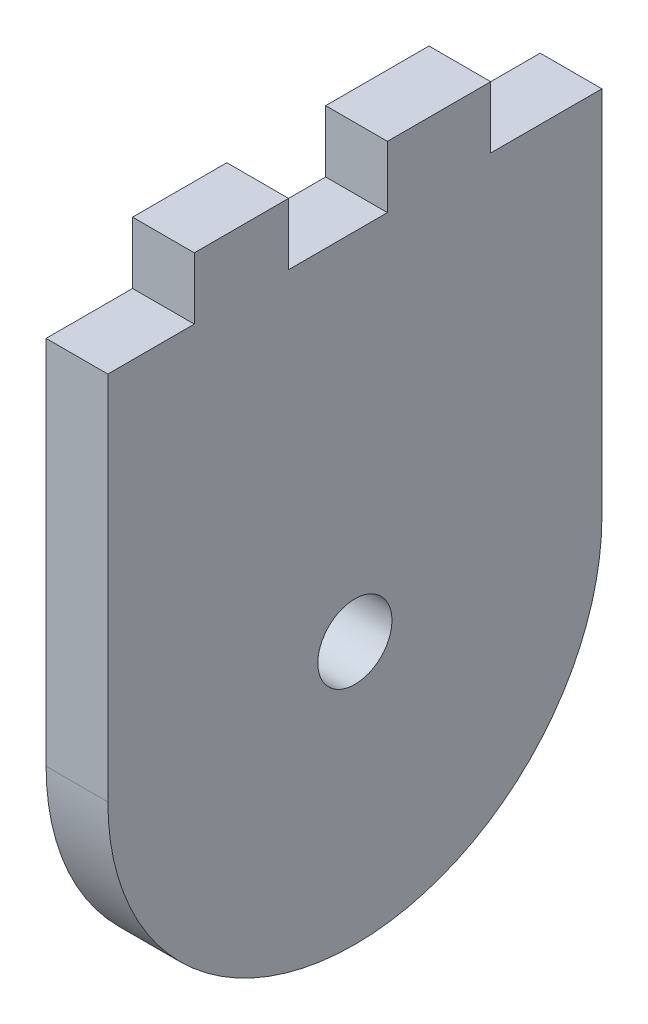
ISO-10303-21;
HEADER;
FILE_DESCRIPTION(('STEP AP214'),'2;1');
FILE_NAME('part.step','',(''),(''),'','','');
FILE_SCHEMA(('AUTOMOTIVE_DESIGN { 1 0 10303 214 1 1 1 1 }'));
ENDSEC;
DATA;
#1=APPLICATION_CONTEXT('core data for automotive mechanical design processes');
#2=APPLICATION_PROTOCOL_DEFINITION('international standard','automotive_design',2000,#1);
#3=PRODUCT_CONTEXT('',#1,'mechanical');
#4=PRODUCT('Part','Part','',(#3));
#5=PRODUCT_RELATED_PRODUCT_CATEGORY('part','',(#4));
#6=PRODUCT_DEFINITION_FORMATION('','',#4);
#7=PRODUCT_DEFINITION_CONTEXT('part definition',#1,'design');
#8=PRODUCT_DEFINITION('design','',#6,#7);
#9=PRODUCT_DEFINITION_SHAPE('','',#8);
#10=(LENGTH_UNIT() NAMED_UNIT(*) SI_UNIT(.MILLI.,.METRE.));
#11=(NAMED_UNIT(*) PLANE_ANGLE_UNIT() SI_UNIT($,.RADIAN.));
#12=(NAMED_UNIT(*) SI_UNIT($,.STERADIAN.) SOLID_ANGLE_UNIT());
#13=UNCERTAINTY_MEASURE_WITH_UNIT(LENGTH_MEASURE(1.E-05),#10,'distance_accuracy_value','');
#14=(GEOMETRIC_REPRESENTATION_CONTEXT(3) GLOBAL_UNCERTAINTY_ASSIGNED_CONTEXT((#13)) GLOBAL_UNIT_ASSIGNED_CONTEXT((#10,
#11,#12)) REPRESENTATION_CONTEXT('',''));
#15=CARTESIAN_POINT('',(0.,0.,0.));
#16=DIRECTION('',(0.,0.,1.));
#17=DIRECTION('',(1.,0.,0.));
#18=AXIS2_PLACEMENT_3D('',#15,#16,#17);
#19=CARTESIAN_POINT('',(-5.,55.,40.));
#20=DIRECTION('',(0.,-1.,0.));
#21=DIRECTION('',(0.,0.,-1.));
#22=AXIS2_PLACEMENT_3D('',#19,#20,#21);
#23=PLANE('',#22);
#24=DIRECTION('',(0.,0.,-1.));
#25=VECTOR('',#24,1.);
#26=CARTESIAN_POINT('',(-5.,55.,40.));
#27=LINE('',#26,#25);
#28=CARTESIAN_POINT('',(-5.,55.,33.));
#29=VERTEX_POINT('',#28);
#30=CARTESIAN_POINT('',(-5.,55.,25.3660375931076));
#31=VERTEX_POINT('',#30);
#32=EDGE_CURVE('E220',#29,#31,#27,.T.);
#33=ORIENTED_EDGE('',*,*,#32,.F.);
#34=DIRECTION('',(-1.,0.,0.));
#35=VECTOR('',#34,1.);
#36=CARTESIAN_POINT('',(0.,55.,33.));
#37=LINE('',#36,#35);
#38=CARTESIAN_POINT('',(0.,55.,33.));
#39=VERTEX_POINT('',#38);
#40=EDGE_CURVE('E192',#39,#29,#37,.T.);
#41=ORIENTED_EDGE('',*,*,#40,.F.);
#42=DIRECTION('',(0.,0.,-1.));
#43=VECTOR('',#42,1.);
#44=CARTESIAN_POINT('',(0.,55.,40.));
#45=LINE('',#44,#43);
#46=CARTESIAN_POINT('',(0.,55.,25.3660375931076));
#47=VERTEX_POINT('',#46);
#48=EDGE_CURVE('E223',#39,#47,#45,.T.);
#49=ORIENTED_EDGE('',*,*,#48,.T.);
#50=DIRECTION('',(-1.,0.,0.));
#51=VECTOR('',#50,1.);
#52=CARTESIAN_POINT('',(0.,55.,25.3660375931076));
#53=LINE('',#52,#51);
#54=EDGE_CURVE('E194',#47,#31,#53,.T.);
#55=ORIENTED_EDGE('',*,*,#54,.T.);
#56=EDGE_LOOP('',(#33,#41,#49,#55));
#57=FACE_BOUND('',#56,.T.);
#58=ADVANCED_FACE('F36',(#57),#23,.F.);
#59=CARTESIAN_POINT('',(0.,51.5,40.));
#60=DIRECTION('',(-1.,0.,0.));
#61=DIRECTION('',(0.,0.,1.));
#62=AXIS2_PLACEMENT_3D('',#59,#60,#61);
#63=PLANE('',#62);
#64=CARTESIAN_POINT('',(0.,21.2375980792143,20.));
#65=DIRECTION('',(-1.,0.,0.));
#66=DIRECTION('',(0.,0.,1.));
#67=AXIS2_PLACEMENT_3D('',#64,#65,#66);
#68=CIRCLE('',#67,3.);
#69=CARTESIAN_POINT('',(0.,21.2375980792143,23.));
#70=VERTEX_POINT('',#69);
#71=EDGE_CURVE('E206',#70,#70,#68,.T.);
#72=ORIENTED_EDGE('',*,*,#71,.T.);
#73=EDGE_LOOP('',(#72));
#74=FACE_BOUND('',#73,.T.);
#75=DIRECTION('',(0.,-1.,0.));
#76=VECTOR('',#75,1.);
#77=CARTESIAN_POINT('',(0.,55.,33.));
#78=LINE('',#77,#76);
#79=CARTESIAN_POINT('',(0.,50.,33.));
#80=VERTEX_POINT('',#79);
#81=EDGE_CURVE('E170',#39,#80,#78,.T.);
#82=ORIENTED_EDGE('',*,*,#81,.T.);
#83=DIRECTION('',(0.,0.,1.));
#84=VECTOR('',#83,1.);
#85=CARTESIAN_POINT('',(0.,50.,33.));
#86=LINE('',#85,#84);
#87=CARTESIAN_POINT('',(0.,50.,40.));
#88=VERTEX_POINT('',#87);
#89=EDGE_CURVE('E172',#80,#88,#86,.T.);
#90=ORIENTED_EDGE('',*,*,#89,.T.);
#91=DIRECTION('',(0.,1.,0.));
#92=VECTOR('',#91,1.);
#93=CARTESIAN_POINT('',(0.,0.,40.));
#94=LINE('',#93,#92);
#95=CARTESIAN_POINT('',(0.,20.,40.));
#96=VERTEX_POINT('',#95);
#97=EDGE_CURVE('E209',#96,#88,#94,.T.);
#98=ORIENTED_EDGE('',*,*,#97,.F.);
#99=CARTESIAN_POINT('',(0.,20.,20.));
#100=DIRECTION('',(-1.,0.,0.));
#101=DIRECTION('',(0.,0.,1.));
#102=AXIS2_PLACEMENT_3D('',#99,#100,#101);
#103=CIRCLE('',#102,20.);
#104=CARTESIAN_POINT('',(0.,0.,20.));
#105=VERTEX_POINT('',#104);
#106=EDGE_CURVE('E224',#96,#105,#103,.F.);
#107=ORIENTED_EDGE('',*,*,#106,.T.);
#108=CARTESIAN_POINT('',(0.,20.,20.));
#109=DIRECTION('',(-1.,0.,0.));
#110=DIRECTION('',(0.,0.,1.));
#111=AXIS2_PLACEMENT_3D('',#108,#109,#110);
#112=CIRCLE('',#111,20.);
#113=CARTESIAN_POINT('',(0.,20.,0.));
#114=VERTEX_POINT('',#113);
#115=EDGE_CURVE('E226',#105,#114,#112,.F.);
#116=ORIENTED_EDGE('',*,*,#115,.T.);
#117=DIRECTION('',(0.,1.,0.));
#118=VECTOR('',#117,1.);
#119=CARTESIAN_POINT('',(0.,51.5,0.));
#120=LINE('',#119,#118);
#121=CARTESIAN_POINT('',(0.,50.,0.));
#122=VERTEX_POINT('',#121);
#123=EDGE_CURVE('E157',#114,#122,#120,.T.);
#124=ORIENTED_EDGE('',*,*,#123,.T.);
#125=DIRECTION('',(0.,0.,1.));
#126=VECTOR('',#125,1.);
#127=CARTESIAN_POINT('',(0.,50.,0.));
#128=LINE('',#127,#126);
#129=CARTESIAN_POINT('',(0.,50.,9.00000000000001));
#130=VERTEX_POINT('',#129);
#131=EDGE_CURVE('E135',#122,#130,#128,.T.);
#132=ORIENTED_EDGE('',*,*,#131,.T.);
#133=DIRECTION('',(0.,1.,0.));
#134=VECTOR('',#133,1.);
#135=CARTESIAN_POINT('',(0.,50.,9.00000000000001));
#136=LINE('',#135,#134);
#137=CARTESIAN_POINT('',(0.,55.,9.));
#138=VERTEX_POINT('',#137);
#139=EDGE_CURVE('E145',#130,#138,#136,.T.);
#140=ORIENTED_EDGE('',*,*,#139,.T.);
#141=CARTESIAN_POINT('',(0.,55.,17.3660375931076));
#142=VERTEX_POINT('',#141);
#143=EDGE_CURVE('E221',#142,#138,#45,.T.);
#144=ORIENTED_EDGE('',*,*,#143,.F.);
#145=DIRECTION('',(0.,-1.,0.));
#146=VECTOR('',#145,1.);
#147=CARTESIAN_POINT('',(0.,55.,17.3660375931076));
#148=LINE('',#147,#146);
#149=CARTESIAN_POINT('',(0.,50.,17.3660375931076));
#150=VERTEX_POINT('',#149);
#151=EDGE_CURVE('E151',#142,#150,#148,.T.);
#152=ORIENTED_EDGE('',*,*,#151,.T.);
#153=DIRECTION('',(0.,0.,1.));
#154=VECTOR('',#153,1.);
#155=CARTESIAN_POINT('',(0.,50.,17.3660375931076));
#156=LINE('',#155,#154);
#157=CARTESIAN_POINT('',(0.,50.,25.3660375931076));
#158=VERTEX_POINT('',#157);
#159=EDGE_CURVE('E164',#150,#158,#156,.T.);
#160=ORIENTED_EDGE('',*,*,#159,.T.);
#161=DIRECTION('',(0.,1.,0.));
#162=VECTOR('',#161,1.);
#163=CARTESIAN_POINT('',(0.,50.,25.3660375931076));
#164=LINE('',#163,#162);
#165=EDGE_CURVE('E167',#158,#47,#164,.T.);
#166=ORIENTED_EDGE('',*,*,#165,.T.);
#167=ORIENTED_EDGE('',*,*,#48,.F.);
#168=EDGE_LOOP('',(#82,#90,#98,#107,#116,#124,#132,#140,#144,#152,#160,#166,#167));
#169=FACE_BOUND('',#168,.T.);
#170=ADVANCED_FACE('F155',(#74,#169),#63,.F.);
#171=CARTESIAN_POINT('',(-5.,55.,17.3660375931076));
#172=VERTEX_POINT('',#171);
#173=CARTESIAN_POINT('',(-5.,55.,9.));
#174=VERTEX_POINT('',#173);
#175=EDGE_CURVE('E215',#172,#174,#27,.T.);
#176=ORIENTED_EDGE('',*,*,#175,.F.);
#177=DIRECTION('',(-1.,0.,0.));
#178=VECTOR('',#177,1.);
#179=CARTESIAN_POINT('',(0.,55.,17.3660375931076));
#180=LINE('',#179,#178);
#181=EDGE_CURVE('E52',#142,#172,#180,.T.);
#182=ORIENTED_EDGE('',*,*,#181,.F.);
#183=ORIENTED_EDGE('',*,*,#143,.T.);
#184=DIRECTION('',(-1.,0.,0.));
#185=VECTOR('',#184,1.);
#186=CARTESIAN_POINT('',(0.,55.,9.));
#187=LINE('',#186,#185);
#188=EDGE_CURVE('E141',#138,#174,#187,.T.);
#189=ORIENTED_EDGE('',*,*,#188,.T.);
#190=EDGE_LOOP('',(#176,#182,#183,#189));
#191=FACE_BOUND('',#190,.T.);
#192=ADVANCED_FACE('F254',(#191),#23,.F.);
#193=CARTESIAN_POINT('',(-5.,0.,40.));
#194=DIRECTION('',(1.,0.,0.));
#195=DIRECTION('',(0.,0.,-1.));
#196=AXIS2_PLACEMENT_3D('',#193,#194,#195);
#197=PLANE('',#196);
#198=CARTESIAN_POINT('',(-5.,21.2375980792143,20.));
#199=DIRECTION('',(-1.,0.,0.));
#200=DIRECTION('',(0.,0.,1.));
#201=AXIS2_PLACEMENT_3D('',#198,#199,#200);
#202=CIRCLE('',#201,3.);
#203=CARTESIAN_POINT('',(-5.,21.2375980792143,23.));
#204=VERTEX_POINT('',#203);
#205=EDGE_CURVE('E189',#204,#204,#202,.T.);
#206=ORIENTED_EDGE('',*,*,#205,.F.);
#207=EDGE_LOOP('',(#206));
#208=FACE_BOUND('',#207,.T.);
#209=DIRECTION('',(0.,-1.,0.));
#210=VECTOR('',#209,1.);
#211=CARTESIAN_POINT('',(-5.,0.,40.));
#212=LINE('',#211,#210);
#213=CARTESIAN_POINT('',(-5.,50.,40.));
#214=VERTEX_POINT('',#213);
#215=CARTESIAN_POINT('',(-5.,20.,40.));
#216=VERTEX_POINT('',#215);
#217=EDGE_CURVE('E212',#214,#216,#212,.T.);
#218=ORIENTED_EDGE('',*,*,#217,.F.);
#219=DIRECTION('',(0.,0.,1.));
#220=VECTOR('',#219,1.);
#221=CARTESIAN_POINT('',(-5.,50.,33.));
#222=LINE('',#221,#220);
#223=CARTESIAN_POINT('',(-5.,50.,33.));
#224=VERTEX_POINT('',#223);
#225=EDGE_CURVE('E60',#224,#214,#222,.T.);
#226=ORIENTED_EDGE('',*,*,#225,.F.);
#227=DIRECTION('',(0.,-1.,0.));
#228=VECTOR('',#227,1.);
#229=CARTESIAN_POINT('',(-5.,55.,33.));
#230=LINE('',#229,#228);
#231=EDGE_CURVE('E159',#29,#224,#230,.T.);
#232=ORIENTED_EDGE('',*,*,#231,.F.);
#233=ORIENTED_EDGE('',*,*,#32,.T.);
#234=DIRECTION('',(0.,1.,0.));
#235=VECTOR('',#234,1.);
#236=CARTESIAN_POINT('',(-5.,50.,25.3660375931076));
#237=LINE('',#236,#235);
#238=CARTESIAN_POINT('',(-5.,50.,25.3660375931076));
#239=VERTEX_POINT('',#238);
#240=EDGE_CURVE('E183',#239,#31,#237,.T.);
#241=ORIENTED_EDGE('',*,*,#240,.F.);
#242=DIRECTION('',(0.,0.,1.));
#243=VECTOR('',#242,1.);
#244=CARTESIAN_POINT('',(-5.,50.,17.3660375931076));
#245=LINE('',#244,#243);
#246=CARTESIAN_POINT('',(-5.,50.,17.3660375931076));
#247=VERTEX_POINT('',#246);
#248=EDGE_CURVE('E180',#247,#239,#245,.T.);
#249=ORIENTED_EDGE('',*,*,#248,.F.);
#250=DIRECTION('',(0.,-1.,0.));
#251=VECTOR('',#250,1.);
#252=CARTESIAN_POINT('',(-5.,55.,17.3660375931076));
#253=LINE('',#252,#251);
#254=EDGE_CURVE('E178',#172,#247,#253,.T.);
#255=ORIENTED_EDGE('',*,*,#254,.F.);
#256=ORIENTED_EDGE('',*,*,#175,.T.);
#257=DIRECTION('',(0.,1.,0.));
#258=VECTOR('',#257,1.);
#259=CARTESIAN_POINT('',(-5.,50.,9.00000000000001));
#260=LINE('',#259,#258);
#261=CARTESIAN_POINT('',(-5.,50.,9.00000000000001));
#262=VERTEX_POINT('',#261);
#263=EDGE_CURVE('E176',#262,#174,#260,.T.);
#264=ORIENTED_EDGE('',*,*,#263,.F.);
#265=DIRECTION('',(0.,0.,1.));
#266=VECTOR('',#265,1.);
#267=CARTESIAN_POINT('',(-5.,50.,0.));
#268=LINE('',#267,#266);
#269=CARTESIAN_POINT('',(-5.,50.,0.));
#270=VERTEX_POINT('',#269);
#271=EDGE_CURVE('E138',#270,#262,#268,.T.);
#272=ORIENTED_EDGE('',*,*,#271,.F.);
#273=DIRECTION('',(0.,-1.,0.));
#274=VECTOR('',#273,1.);
#275=CARTESIAN_POINT('',(-5.,0.,0.));
#276=LINE('',#275,#274);
#277=CARTESIAN_POINT('',(-5.,20.,0.));
#278=VERTEX_POINT('',#277);
#279=EDGE_CURVE('E213',#270,#278,#276,.T.);
#280=ORIENTED_EDGE('',*,*,#279,.T.);
#281=CARTESIAN_POINT('',(-5.,20.,20.));
#282=DIRECTION('',(1.,0.,0.));
#283=DIRECTION('',(0.,0.,-1.));
#284=AXIS2_PLACEMENT_3D('',#281,#282,#283);
#285=CIRCLE('',#284,20.);
#286=CARTESIAN_POINT('',(-5.,0.,20.));
#287=VERTEX_POINT('',#286);
#288=EDGE_CURVE('E45',#278,#287,#285,.F.);
#289=ORIENTED_EDGE('',*,*,#288,.T.);
#290=CARTESIAN_POINT('',(-5.,20.,20.));
#291=DIRECTION('',(1.,0.,0.));
#292=DIRECTION('',(0.,0.,-1.));
#293=AXIS2_PLACEMENT_3D('',#290,#291,#292);
#294=CIRCLE('',#293,20.);
#295=EDGE_CURVE('E231',#287,#216,#294,.F.);
#296=ORIENTED_EDGE('',*,*,#295,.T.);
#297=EDGE_LOOP('',(#218,#226,#232,#233,#241,#249,#255,#256,#264,#272,#280,#289,#296));
#298=FACE_BOUND('',#297,.T.);
#299=ADVANCED_FACE('F238',(#208,#298),#197,.F.);
#300=CARTESIAN_POINT('',(0.,0.,40.));
#301=DIRECTION('',(0.,0.,-1.));
#302=DIRECTION('',(-1.,0.,0.));
#303=AXIS2_PLACEMENT_3D('',#300,#301,#302);
#304=PLANE('',#303);
#305=ORIENTED_EDGE('',*,*,#97,.T.);
#306=DIRECTION('',(-1.,0.,0.));
#307=VECTOR('',#306,1.);
#308=CARTESIAN_POINT('',(0.,50.,40.));
#309=LINE('',#308,#307);
#310=EDGE_CURVE('E187',#88,#214,#309,.T.);
#311=ORIENTED_EDGE('',*,*,#310,.T.);
#312=ORIENTED_EDGE('',*,*,#217,.T.);
#313=DIRECTION('',(1.,0.,0.));
#314=VECTOR('',#313,1.);
#315=CARTESIAN_POINT('',(0.,20.,40.));
#316=LINE('',#315,#314);
#317=EDGE_CURVE('E11',#216,#96,#316,.T.);
#318=ORIENTED_EDGE('',*,*,#317,.T.);
#319=EDGE_LOOP('',(#305,#311,#312,#318));
#320=FACE_BOUND('',#319,.T.);
#321=ADVANCED_FACE('F274',(#320),#304,.F.);
#322=CARTESIAN_POINT('',(0.,0.,0.));
#323=DIRECTION('',(0.,0.,-1.));
#324=DIRECTION('',(-1.,0.,0.));
#325=AXIS2_PLACEMENT_3D('',#322,#323,#324);
#326=PLANE('',#325);
#327=DIRECTION('',(-1.,0.,0.));
#328=VECTOR('',#327,1.);
#329=CARTESIAN_POINT('',(0.,50.,0.));
#330=LINE('',#329,#328);
#331=EDGE_CURVE('E142',#122,#270,#330,.T.);
#332=ORIENTED_EDGE('',*,*,#331,.F.);
#333=ORIENTED_EDGE('',*,*,#123,.F.);
#334=DIRECTION('',(1.,0.,0.));
#335=VECTOR('',#334,1.);
#336=CARTESIAN_POINT('',(-5.,20.,0.));
#337=LINE('',#336,#335);
#338=EDGE_CURVE('E228',#114,#278,#337,.F.);
#339=ORIENTED_EDGE('',*,*,#338,.T.);
#340=ORIENTED_EDGE('',*,*,#279,.F.);
#341=EDGE_LOOP('',(#332,#333,#339,#340));
#342=FACE_BOUND('',#341,.T.);
#343=ADVANCED_FACE('F251',(#342),#326,.T.);
#344=CARTESIAN_POINT('',(0.,20.,20.));
#345=DIRECTION('',(1.,0.,0.));
#346=DIRECTION('',(0.,1.,0.));
#347=AXIS2_PLACEMENT_3D('',#344,#345,#346);
#348=CYLINDRICAL_SURFACE('',#347,20.);
#349=ORIENTED_EDGE('',*,*,#317,.F.);
#350=ORIENTED_EDGE('',*,*,#295,.F.);
#351=DIRECTION('',(1.,0.,0.));
#352=VECTOR('',#351,1.);
#353=CARTESIAN_POINT('',(0.,0.,20.));
#354=LINE('',#353,#352);
#355=EDGE_CURVE('E40',#105,#287,#354,.F.);
#356=ORIENTED_EDGE('',*,*,#355,.F.);
#357=ORIENTED_EDGE('',*,*,#106,.F.);
#358=EDGE_LOOP('',(#349,#350,#356,#357));
#359=FACE_BOUND('',#358,.T.);
#360=ADVANCED_FACE('F38',(#359),#348,.T.);
#361=CARTESIAN_POINT('',(0.,20.,20.));
#362=DIRECTION('',(-1.,0.,0.));
#363=DIRECTION('',(0.,-1.,0.));
#364=AXIS2_PLACEMENT_3D('',#361,#362,#363);
#365=CYLINDRICAL_SURFACE('',#364,20.);
#366=ORIENTED_EDGE('',*,*,#288,.F.);
#367=ORIENTED_EDGE('',*,*,#338,.F.);
#368=ORIENTED_EDGE('',*,*,#115,.F.);
#369=ORIENTED_EDGE('',*,*,#355,.T.);
#370=EDGE_LOOP('',(#366,#367,#368,#369));
#371=FACE_BOUND('',#370,.T.);
#372=ADVANCED_FACE('F248',(#371),#365,.T.);
#373=CARTESIAN_POINT('',(5.,21.2375980792143,20.));
#374=DIRECTION('',(-1.,0.,0.));
#375=DIRECTION('',(0.,0.,1.));
#376=AXIS2_PLACEMENT_3D('',#373,#374,#375);
#377=CYLINDRICAL_SURFACE('',#376,3.);
#378=ORIENTED_EDGE('',*,*,#205,.T.);
#379=EDGE_LOOP('',(#378));
#380=FACE_BOUND('',#379,.T.);
#381=ORIENTED_EDGE('',*,*,#71,.F.);
#382=EDGE_LOOP('',(#381));
#383=FACE_BOUND('',#382,.T.);
#384=ADVANCED_FACE('F306',(#380,#383),#377,.F.);
#385=CARTESIAN_POINT('',(0.,50.,0.));
#386=DIRECTION('',(0.,-1.,0.));
#387=DIRECTION('',(0.,0.,-1.));
#388=AXIS2_PLACEMENT_3D('',#385,#386,#387);
#389=PLANE('',#388);
#390=ORIENTED_EDGE('',*,*,#271,.T.);
#391=DIRECTION('',(-1.,0.,0.));
#392=VECTOR('',#391,1.);
#393=CARTESIAN_POINT('',(0.,50.,9.00000000000001));
#394=LINE('',#393,#392);
#395=EDGE_CURVE('E131',#130,#262,#394,.T.);
#396=ORIENTED_EDGE('',*,*,#395,.F.);
#397=ORIENTED_EDGE('',*,*,#131,.F.);
#398=ORIENTED_EDGE('',*,*,#331,.T.);
#399=EDGE_LOOP('',(#390,#396,#397,#398));
#400=FACE_BOUND('',#399,.T.);
#401=ADVANCED_FACE('F133',(#400),#389,.F.);
#402=CARTESIAN_POINT('',(0.,50.,9.00000000000001));
#403=DIRECTION('',(0.,0.,1.));
#404=DIRECTION('',(0.,-1.,0.));
#405=AXIS2_PLACEMENT_3D('',#402,#403,#404);
#406=PLANE('',#405);
#407=ORIENTED_EDGE('',*,*,#263,.T.);
#408=ORIENTED_EDGE('',*,*,#188,.F.);
#409=ORIENTED_EDGE('',*,*,#139,.F.);
#410=ORIENTED_EDGE('',*,*,#395,.T.);
#411=EDGE_LOOP('',(#407,#408,#409,#410));
#412=FACE_BOUND('',#411,.T.);
#413=ADVANCED_FACE('F146',(#412),#406,.F.);
#414=CARTESIAN_POINT('',(0.,50.,33.));
#415=DIRECTION('',(0.,-1.,0.));
#416=DIRECTION('',(0.,0.,-1.));
#417=AXIS2_PLACEMENT_3D('',#414,#415,#416);
#418=PLANE('',#417);
#419=ORIENTED_EDGE('',*,*,#225,.T.);
#420=ORIENTED_EDGE('',*,*,#310,.F.);
#421=ORIENTED_EDGE('',*,*,#89,.F.);
#422=DIRECTION('',(-1.,0.,0.));
#423=VECTOR('',#422,1.);
#424=CARTESIAN_POINT('',(0.,50.,33.));
#425=LINE('',#424,#423);
#426=EDGE_CURVE('E190',#80,#224,#425,.T.);
#427=ORIENTED_EDGE('',*,*,#426,.T.);
#428=EDGE_LOOP('',(#419,#420,#421,#427));
#429=FACE_BOUND('',#428,.T.);
#430=ADVANCED_FACE('F276',(#429),#418,.F.);
#431=CARTESIAN_POINT('',(0.,55.,33.));
#432=DIRECTION('',(0.,0.,-1.));
#433=DIRECTION('',(-1.,0.,0.));
#434=AXIS2_PLACEMENT_3D('',#431,#432,#433);
#435=PLANE('',#434);
#436=ORIENTED_EDGE('',*,*,#231,.T.);
#437=ORIENTED_EDGE('',*,*,#426,.F.);
#438=ORIENTED_EDGE('',*,*,#81,.F.);
#439=ORIENTED_EDGE('',*,*,#40,.T.);
#440=EDGE_LOOP('',(#436,#437,#438,#439));
#441=FACE_BOUND('',#440,.T.);
#442=ADVANCED_FACE('F272',(#441),#435,.F.);
#443=CARTESIAN_POINT('',(0.,50.,25.3660375931076));
#444=DIRECTION('',(0.,0.,1.));
#445=DIRECTION('',(1.,0.,0.));
#446=AXIS2_PLACEMENT_3D('',#443,#444,#445);
#447=PLANE('',#446);
#448=ORIENTED_EDGE('',*,*,#240,.T.);
#449=ORIENTED_EDGE('',*,*,#54,.F.);
#450=ORIENTED_EDGE('',*,*,#165,.F.);
#451=DIRECTION('',(-1.,0.,0.));
#452=VECTOR('',#451,1.);
#453=CARTESIAN_POINT('',(0.,50.,25.3660375931076));
#454=LINE('',#453,#452);
#455=EDGE_CURVE('E197',#158,#239,#454,.T.);
#456=ORIENTED_EDGE('',*,*,#455,.T.);
#457=EDGE_LOOP('',(#448,#449,#450,#456));
#458=FACE_BOUND('',#457,.T.);
#459=ADVANCED_FACE('F263',(#458),#447,.F.);
#460=CARTESIAN_POINT('',(0.,50.,17.3660375931076));
#461=DIRECTION('',(0.,-1.,0.));
#462=DIRECTION('',(0.,0.,-1.));
#463=AXIS2_PLACEMENT_3D('',#460,#461,#462);
#464=PLANE('',#463);
#465=ORIENTED_EDGE('',*,*,#248,.T.);
#466=ORIENTED_EDGE('',*,*,#455,.F.);
#467=ORIENTED_EDGE('',*,*,#159,.F.);
#468=DIRECTION('',(-1.,0.,0.));
#469=VECTOR('',#468,1.);
#470=CARTESIAN_POINT('',(0.,50.,17.3660375931076));
#471=LINE('',#470,#469);
#472=EDGE_CURVE('E199',#150,#247,#471,.T.);
#473=ORIENTED_EDGE('',*,*,#472,.T.);
#474=EDGE_LOOP('',(#465,#466,#467,#473));
#475=FACE_BOUND('',#474,.T.);
#476=ADVANCED_FACE('F259',(#475),#464,.F.);
#477=CARTESIAN_POINT('',(0.,55.,17.3660375931076));
#478=DIRECTION('',(0.,0.,-1.));
#479=DIRECTION('',(-1.,0.,0.));
#480=AXIS2_PLACEMENT_3D('',#477,#478,#479);
#481=PLANE('',#480);
#482=ORIENTED_EDGE('',*,*,#254,.T.);
#483=ORIENTED_EDGE('',*,*,#472,.F.);
#484=ORIENTED_EDGE('',*,*,#151,.F.);
#485=ORIENTED_EDGE('',*,*,#181,.T.);
#486=EDGE_LOOP('',(#482,#483,#484,#485));
#487=FACE_BOUND('',#486,.T.);
#488=ADVANCED_FACE('F256',(#487),#481,.F.);
#489=CLOSED_SHELL('',(#58,#170,#192,#299,#321,#343,#360,#372,#384,#401,#413,#430,#442,#459,#476,#488));
#490=MANIFOLD_SOLID_BREP('B2',#489);
#491=ADVANCED_BREP_SHAPE_REPRESENTATION('',(#18,#490),#14);
#492=SHAPE_DEFINITION_REPRESENTATION(#9,#491);
ENDSEC;
END-ISO-10303-21;
